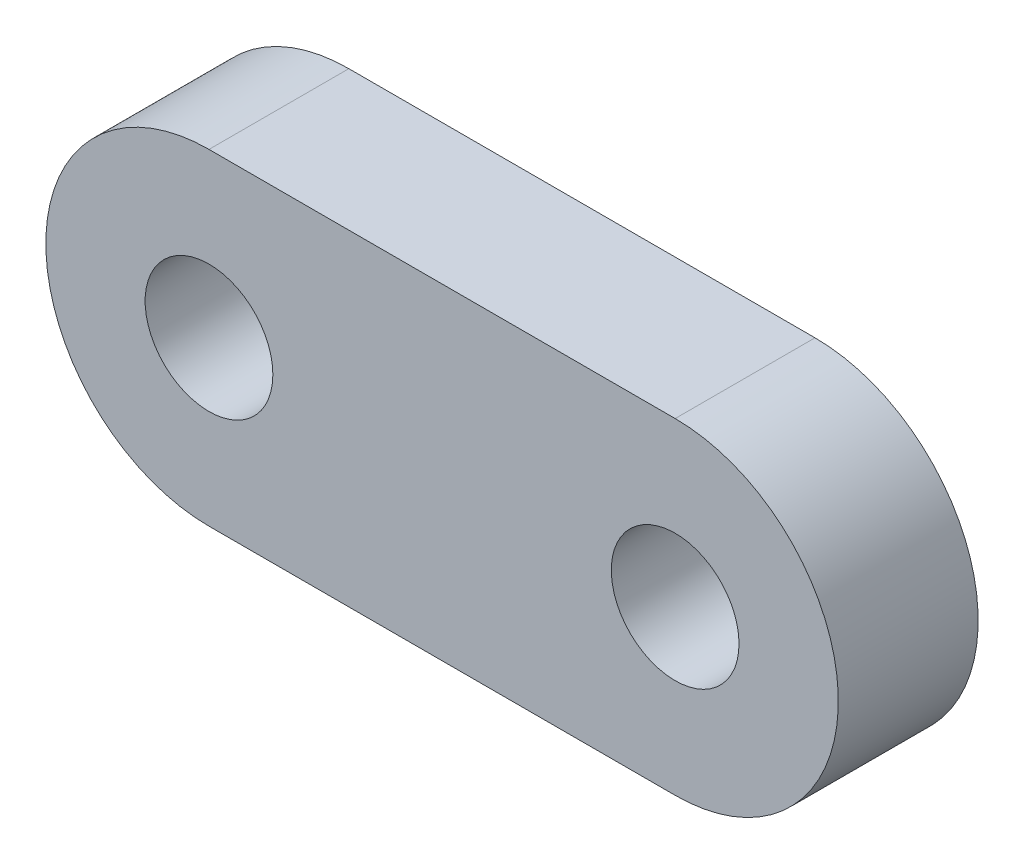
ISO-10303-21;
HEADER;
FILE_DESCRIPTION(('STEP AP214'),'2;1');
FILE_NAME('part.step','',(''),(''),'','','');
FILE_SCHEMA(('AUTOMOTIVE_DESIGN { 1 0 10303 214 1 1 1 1 }'));
ENDSEC;
DATA;
#1=APPLICATION_CONTEXT('core data for automotive mechanical design processes');
#2=APPLICATION_PROTOCOL_DEFINITION('international standard','automotive_design',2000,#1);
#3=PRODUCT_CONTEXT('',#1,'mechanical');
#4=PRODUCT('Part','Part','',(#3));
#5=PRODUCT_RELATED_PRODUCT_CATEGORY('part','',(#4));
#6=PRODUCT_DEFINITION_FORMATION('','',#4);
#7=PRODUCT_DEFINITION_CONTEXT('part definition',#1,'design');
#8=PRODUCT_DEFINITION('design','',#6,#7);
#9=PRODUCT_DEFINITION_SHAPE('','',#8);
#10=(LENGTH_UNIT() NAMED_UNIT(*) SI_UNIT(.MILLI.,.METRE.));
#11=(NAMED_UNIT(*) PLANE_ANGLE_UNIT() SI_UNIT($,.RADIAN.));
#12=(NAMED_UNIT(*) SI_UNIT($,.STERADIAN.) SOLID_ANGLE_UNIT());
#13=UNCERTAINTY_MEASURE_WITH_UNIT(LENGTH_MEASURE(1.E-05),#10,'distance_accuracy_value','');
#14=(GEOMETRIC_REPRESENTATION_CONTEXT(3) GLOBAL_UNCERTAINTY_ASSIGNED_CONTEXT((#13)) GLOBAL_UNIT_ASSIGNED_CONTEXT((#10,
#11,#12)) REPRESENTATION_CONTEXT('',''));
#15=CARTESIAN_POINT('',(0.,0.,0.));
#16=DIRECTION('',(0.,0.,1.));
#17=DIRECTION('',(1.,0.,0.));
#18=AXIS2_PLACEMENT_3D('',#15,#16,#17);
#19=CARTESIAN_POINT('',(0.,0.,3.81));
#20=DIRECTION('',(0.,0.,-1.));
#21=DIRECTION('',(-1.,0.,0.));
#22=AXIS2_PLACEMENT_3D('',#19,#20,#21);
#23=CYLINDRICAL_SURFACE('',#22,4.445);
#24=CARTESIAN_POINT('',(0.,0.,0.));
#25=DIRECTION('',(0.,0.,1.));
#26=DIRECTION('',(1.,0.,0.));
#27=AXIS2_PLACEMENT_3D('',#24,#25,#26);
#28=CIRCLE('',#27,4.445);
#29=CARTESIAN_POINT('',(0.,4.445,0.));
#30=VERTEX_POINT('',#29);
#31=CARTESIAN_POINT('',(0.,-4.445,0.));
#32=VERTEX_POINT('',#31);
#33=EDGE_CURVE('E96',#30,#32,#28,.T.);
#34=ORIENTED_EDGE('',*,*,#33,.T.);
#35=DIRECTION('',(0.,0.,-1.));
#36=VECTOR('',#35,1.);
#37=CARTESIAN_POINT('',(0.,-4.445,3.81));
#38=LINE('',#37,#36);
#39=CARTESIAN_POINT('',(0.,-4.445,3.81));
#40=VERTEX_POINT('',#39);
#41=EDGE_CURVE('E11',#40,#32,#38,.T.);
#42=ORIENTED_EDGE('',*,*,#41,.F.);
#43=CARTESIAN_POINT('',(0.,0.,3.81));
#44=DIRECTION('',(0.,0.,1.));
#45=DIRECTION('',(1.,0.,0.));
#46=AXIS2_PLACEMENT_3D('',#43,#44,#45);
#47=CIRCLE('',#46,4.445);
#48=CARTESIAN_POINT('',(0.,4.445,3.81));
#49=VERTEX_POINT('',#48);
#50=EDGE_CURVE('E84',#49,#40,#47,.T.);
#51=ORIENTED_EDGE('',*,*,#50,.F.);
#52=DIRECTION('',(0.,0.,-1.));
#53=VECTOR('',#52,1.);
#54=CARTESIAN_POINT('',(0.,4.445,3.81));
#55=LINE('',#54,#53);
#56=EDGE_CURVE('E92',#49,#30,#55,.T.);
#57=ORIENTED_EDGE('',*,*,#56,.T.);
#58=EDGE_LOOP('',(#34,#42,#51,#57));
#59=FACE_BOUND('',#58,.T.);
#60=ADVANCED_FACE('F33',(#59),#23,.T.);
#61=CARTESIAN_POINT('',(0.,-4.445,3.81));
#62=DIRECTION('',(0.,1.,0.));
#63=DIRECTION('',(0.,0.,1.));
#64=AXIS2_PLACEMENT_3D('',#61,#62,#63);
#65=PLANE('',#64);
#66=DIRECTION('',(1.,0.,0.));
#67=VECTOR('',#66,1.);
#68=CARTESIAN_POINT('',(0.,-4.445,0.));
#69=LINE('',#68,#67);
#70=CARTESIAN_POINT('',(12.7,-4.445,0.));
#71=VERTEX_POINT('',#70);
#72=EDGE_CURVE('E88',#32,#71,#69,.T.);
#73=ORIENTED_EDGE('',*,*,#72,.T.);
#74=DIRECTION('',(0.,0.,-1.));
#75=VECTOR('',#74,1.);
#76=CARTESIAN_POINT('',(12.7,-4.445,3.81));
#77=LINE('',#76,#75);
#78=CARTESIAN_POINT('',(12.7,-4.445,3.81));
#79=VERTEX_POINT('',#78);
#80=EDGE_CURVE('E41',#79,#71,#77,.T.);
#81=ORIENTED_EDGE('',*,*,#80,.F.);
#82=DIRECTION('',(1.,0.,0.));
#83=VECTOR('',#82,1.);
#84=CARTESIAN_POINT('',(0.,-4.445,3.81));
#85=LINE('',#84,#83);
#86=EDGE_CURVE('E79',#40,#79,#85,.T.);
#87=ORIENTED_EDGE('',*,*,#86,.F.);
#88=ORIENTED_EDGE('',*,*,#41,.T.);
#89=EDGE_LOOP('',(#73,#81,#87,#88));
#90=FACE_BOUND('',#89,.T.);
#91=ADVANCED_FACE('F87',(#90),#65,.F.);
#92=CARTESIAN_POINT('',(12.7,0.,3.81));
#93=DIRECTION('',(0.,0.,-1.));
#94=DIRECTION('',(-1.,0.,0.));
#95=AXIS2_PLACEMENT_3D('',#92,#93,#94);
#96=CYLINDRICAL_SURFACE('',#95,4.445);
#97=CARTESIAN_POINT('',(12.7,0.,0.));
#98=DIRECTION('',(0.,0.,1.));
#99=DIRECTION('',(1.,0.,0.));
#100=AXIS2_PLACEMENT_3D('',#97,#98,#99);
#101=CIRCLE('',#100,4.445);
#102=CARTESIAN_POINT('',(12.7,4.445,0.));
#103=VERTEX_POINT('',#102);
#104=EDGE_CURVE('E66',#71,#103,#101,.T.);
#105=ORIENTED_EDGE('',*,*,#104,.T.);
#106=DIRECTION('',(0.,0.,-1.));
#107=VECTOR('',#106,1.);
#108=CARTESIAN_POINT('',(12.7,4.445,3.81));
#109=LINE('',#108,#107);
#110=CARTESIAN_POINT('',(12.7,4.445,3.81));
#111=VERTEX_POINT('',#110);
#112=EDGE_CURVE('E89',#111,#103,#109,.T.);
#113=ORIENTED_EDGE('',*,*,#112,.F.);
#114=CARTESIAN_POINT('',(12.7,0.,3.81));
#115=DIRECTION('',(0.,0.,1.));
#116=DIRECTION('',(1.,0.,0.));
#117=AXIS2_PLACEMENT_3D('',#114,#115,#116);
#118=CIRCLE('',#117,4.445);
#119=EDGE_CURVE('E82',#79,#111,#118,.T.);
#120=ORIENTED_EDGE('',*,*,#119,.F.);
#121=ORIENTED_EDGE('',*,*,#80,.T.);
#122=EDGE_LOOP('',(#105,#113,#120,#121));
#123=FACE_BOUND('',#122,.T.);
#124=ADVANCED_FACE('F90',(#123),#96,.T.);
#125=CARTESIAN_POINT('',(0.,4.445,3.81));
#126=DIRECTION('',(0.,-1.,0.));
#127=DIRECTION('',(0.,0.,-1.));
#128=AXIS2_PLACEMENT_3D('',#125,#126,#127);
#129=PLANE('',#128);
#130=DIRECTION('',(-1.,0.,0.));
#131=VECTOR('',#130,1.);
#132=CARTESIAN_POINT('',(0.,4.445,0.));
#133=LINE('',#132,#131);
#134=EDGE_CURVE('E72',#103,#30,#133,.T.);
#135=ORIENTED_EDGE('',*,*,#134,.T.);
#136=ORIENTED_EDGE('',*,*,#56,.F.);
#137=DIRECTION('',(-1.,0.,0.));
#138=VECTOR('',#137,1.);
#139=CARTESIAN_POINT('',(0.,4.445,3.81));
#140=LINE('',#139,#138);
#141=EDGE_CURVE('E49',#111,#49,#140,.T.);
#142=ORIENTED_EDGE('',*,*,#141,.F.);
#143=ORIENTED_EDGE('',*,*,#112,.T.);
#144=EDGE_LOOP('',(#135,#136,#142,#143));
#145=FACE_BOUND('',#144,.T.);
#146=ADVANCED_FACE('F104',(#145),#129,.F.);
#147=CARTESIAN_POINT('',(0.,0.,3.81));
#148=DIRECTION('',(0.,0.,1.));
#149=DIRECTION('',(1.,0.,0.));
#150=AXIS2_PLACEMENT_3D('',#147,#148,#149);
#151=PLANE('',#150);
#152=CARTESIAN_POINT('',(12.7,0.,3.81));
#153=DIRECTION('',(0.,0.,1.));
#154=DIRECTION('',(1.,0.,0.));
#155=AXIS2_PLACEMENT_3D('',#152,#153,#154);
#156=CIRCLE('',#155,1.7399);
#157=CARTESIAN_POINT('',(14.4399,0.,3.81));
#158=VERTEX_POINT('',#157);
#159=EDGE_CURVE('E115',#158,#158,#156,.F.);
#160=ORIENTED_EDGE('',*,*,#159,.T.);
#161=EDGE_LOOP('',(#160));
#162=FACE_BOUND('',#161,.T.);
#163=CARTESIAN_POINT('',(0.,0.,3.81));
#164=DIRECTION('',(0.,0.,1.));
#165=DIRECTION('',(1.,0.,0.));
#166=AXIS2_PLACEMENT_3D('',#163,#164,#165);
#167=CIRCLE('',#166,1.7399);
#168=CARTESIAN_POINT('',(1.7399,0.,3.81));
#169=VERTEX_POINT('',#168);
#170=EDGE_CURVE('E99',#169,#169,#167,.T.);
#171=ORIENTED_EDGE('',*,*,#170,.F.);
#172=EDGE_LOOP('',(#171));
#173=FACE_BOUND('',#172,.T.);
#174=ORIENTED_EDGE('',*,*,#50,.T.);
#175=ORIENTED_EDGE('',*,*,#86,.T.);
#176=ORIENTED_EDGE('',*,*,#119,.T.);
#177=ORIENTED_EDGE('',*,*,#141,.T.);
#178=EDGE_LOOP('',(#174,#175,#176,#177));
#179=FACE_BOUND('',#178,.T.);
#180=ADVANCED_FACE('F80',(#162,#173,#179),#151,.T.);
#181=CARTESIAN_POINT('',(0.,0.,0.));
#182=DIRECTION('',(0.,0.,1.));
#183=DIRECTION('',(1.,0.,0.));
#184=AXIS2_PLACEMENT_3D('',#181,#182,#183);
#185=PLANE('',#184);
#186=CARTESIAN_POINT('',(12.7,0.,0.));
#187=DIRECTION('',(0.,0.,-1.));
#188=DIRECTION('',(-1.,0.,0.));
#189=AXIS2_PLACEMENT_3D('',#186,#187,#188);
#190=CIRCLE('',#189,1.7399);
#191=CARTESIAN_POINT('',(10.9601,0.,0.));
#192=VERTEX_POINT('',#191);
#193=EDGE_CURVE('E118',#192,#192,#190,.T.);
#194=ORIENTED_EDGE('',*,*,#193,.F.);
#195=EDGE_LOOP('',(#194));
#196=FACE_BOUND('',#195,.T.);
#197=CARTESIAN_POINT('',(0.,0.,0.));
#198=DIRECTION('',(0.,0.,1.));
#199=DIRECTION('',(1.,0.,0.));
#200=AXIS2_PLACEMENT_3D('',#197,#198,#199);
#201=CIRCLE('',#200,1.7399);
#202=CARTESIAN_POINT('',(1.7399,0.,0.));
#203=VERTEX_POINT('',#202);
#204=EDGE_CURVE('E112',#203,#203,#201,.T.);
#205=ORIENTED_EDGE('',*,*,#204,.T.);
#206=EDGE_LOOP('',(#205));
#207=FACE_BOUND('',#206,.T.);
#208=ORIENTED_EDGE('',*,*,#33,.F.);
#209=ORIENTED_EDGE('',*,*,#134,.F.);
#210=ORIENTED_EDGE('',*,*,#104,.F.);
#211=ORIENTED_EDGE('',*,*,#72,.F.);
#212=EDGE_LOOP('',(#208,#209,#210,#211));
#213=FACE_BOUND('',#212,.T.);
#214=ADVANCED_FACE('F107',(#196,#207,#213),#185,.F.);
#215=CARTESIAN_POINT('',(0.,0.,0.));
#216=DIRECTION('',(0.,0.,1.));
#217=DIRECTION('',(1.,0.,0.));
#218=AXIS2_PLACEMENT_3D('',#215,#216,#217);
#219=CYLINDRICAL_SURFACE('',#218,1.7399);
#220=ORIENTED_EDGE('',*,*,#170,.T.);
#221=EDGE_LOOP('',(#220));
#222=FACE_BOUND('',#221,.T.);
#223=ORIENTED_EDGE('',*,*,#204,.F.);
#224=EDGE_LOOP('',(#223));
#225=FACE_BOUND('',#224,.T.);
#226=ADVANCED_FACE('F126',(#222,#225),#219,.F.);
#227=CARTESIAN_POINT('',(12.7,0.,0.));
#228=DIRECTION('',(0.,0.,1.));
#229=DIRECTION('',(1.,0.,0.));
#230=AXIS2_PLACEMENT_3D('',#227,#228,#229);
#231=CYLINDRICAL_SURFACE('',#230,1.7399);
#232=ORIENTED_EDGE('',*,*,#159,.F.);
#233=EDGE_LOOP('',(#232));
#234=FACE_BOUND('',#233,.T.);
#235=ORIENTED_EDGE('',*,*,#193,.T.);
#236=EDGE_LOOP('',(#235));
#237=FACE_BOUND('',#236,.T.);
#238=ADVANCED_FACE('F122',(#234,#237),#231,.F.);
#239=CLOSED_SHELL('',(#60,#91,#124,#146,#180,#214,#226,#238));
#240=MANIFOLD_SOLID_BREP('B2',#239);
#241=ADVANCED_BREP_SHAPE_REPRESENTATION('',(#18,#240),#14);
#242=SHAPE_DEFINITION_REPRESENTATION(#9,#241);
ENDSEC;
END-ISO-10303-21;
